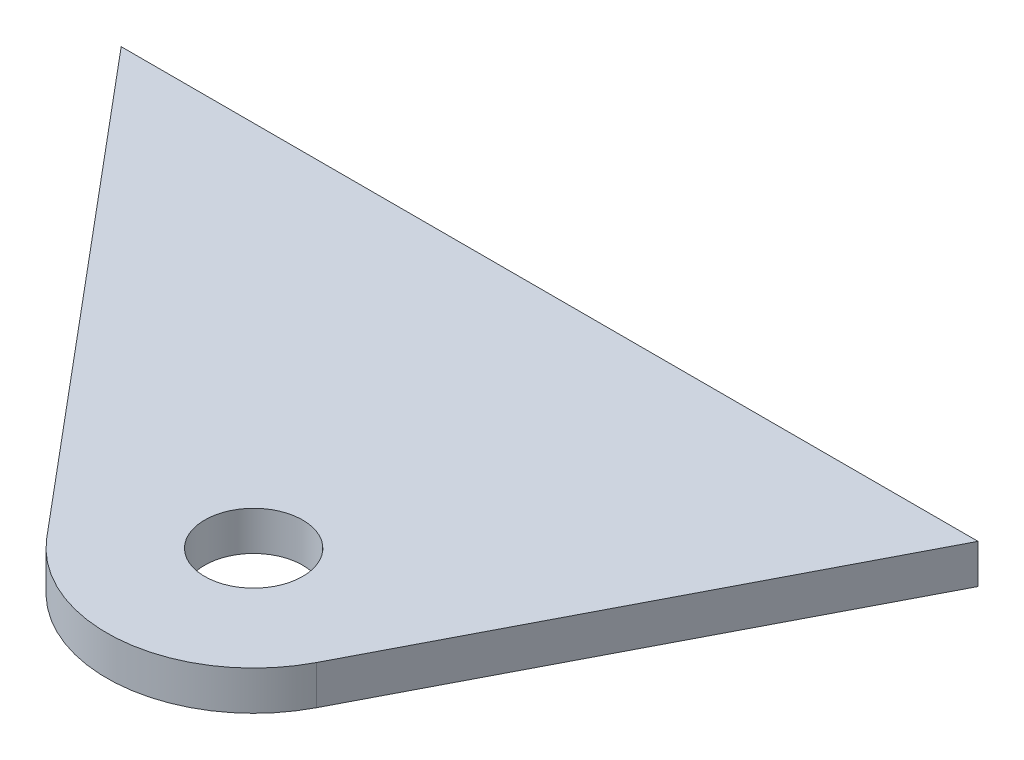
ISO-10303-21;
HEADER;
FILE_DESCRIPTION(('STEP AP214'),'2;1');
FILE_NAME('part.step','',(''),(''),'','','');
FILE_SCHEMA(('AUTOMOTIVE_DESIGN { 1 0 10303 214 1 1 1 1 }'));
ENDSEC;
DATA;
#1=APPLICATION_CONTEXT('core data for automotive mechanical design processes');
#2=APPLICATION_PROTOCOL_DEFINITION('international standard','automotive_design',2000,#1);
#3=PRODUCT_CONTEXT('',#1,'mechanical');
#4=PRODUCT('Part','Part','',(#3));
#5=PRODUCT_RELATED_PRODUCT_CATEGORY('part','',(#4));
#6=PRODUCT_DEFINITION_FORMATION('','',#4);
#7=PRODUCT_DEFINITION_CONTEXT('part definition',#1,'design');
#8=PRODUCT_DEFINITION('design','',#6,#7);
#9=PRODUCT_DEFINITION_SHAPE('','',#8);
#10=(LENGTH_UNIT() NAMED_UNIT(*) SI_UNIT(.MILLI.,.METRE.));
#11=(NAMED_UNIT(*) PLANE_ANGLE_UNIT() SI_UNIT($,.RADIAN.));
#12=(NAMED_UNIT(*) SI_UNIT($,.STERADIAN.) SOLID_ANGLE_UNIT());
#13=UNCERTAINTY_MEASURE_WITH_UNIT(LENGTH_MEASURE(1.E-05),#10,'distance_accuracy_value','');
#14=(GEOMETRIC_REPRESENTATION_CONTEXT(3) GLOBAL_UNCERTAINTY_ASSIGNED_CONTEXT((#13)) GLOBAL_UNIT_ASSIGNED_CONTEXT((#10,
#11,#12)) REPRESENTATION_CONTEXT('',''));
#15=CARTESIAN_POINT('',(0.,0.,0.));
#16=DIRECTION('',(0.,0.,1.));
#17=DIRECTION('',(1.,0.,0.));
#18=AXIS2_PLACEMENT_3D('',#15,#16,#17);
#19=CARTESIAN_POINT('',(101.6,354.33,279.4));
#20=DIRECTION('',(0.,-1.,0.));
#21=DIRECTION('',(1.,0.,0.));
#22=AXIS2_PLACEMENT_3D('',#19,#20,#21);
#23=PLANE('',#22);
#24=CARTESIAN_POINT('',(101.6,354.33,279.4));
#25=DIRECTION('',(0.,-1.,0.));
#26=DIRECTION('',(1.,0.,0.));
#27=AXIS2_PLACEMENT_3D('',#24,#25,#26);
#28=CIRCLE('',#27,3.175);
#29=CARTESIAN_POINT('',(104.775,354.33,279.4));
#30=VERTEX_POINT('',#29);
#31=EDGE_CURVE('E105',#30,#30,#28,.T.);
#32=ORIENTED_EDGE('',*,*,#31,.T.);
#33=EDGE_LOOP('',(#32));
#34=FACE_BOUND('',#33,.T.);
#35=DIRECTION('',(-0.642787609686537,0.,-0.76604444311898));
#36=VECTOR('',#35,1.);
#37=CARTESIAN_POINT('',(69.1316527751214,354.33,255.524));
#38=LINE('',#37,#36);
#39=CARTESIAN_POINT('',(94.3034266792917,354.33,285.522551982264));
#40=VERTEX_POINT('',#39);
#41=CARTESIAN_POINT('',(69.1316527751214,354.33,255.524));
#42=VERTEX_POINT('',#41);
#43=EDGE_CURVE('E96',#40,#42,#38,.T.);
#44=ORIENTED_EDGE('',*,*,#43,.F.);
#45=CARTESIAN_POINT('',(101.6,354.33,279.4));
#46=DIRECTION('',(0.,-1.,0.));
#47=DIRECTION('',(1.,0.,0.));
#48=AXIS2_PLACEMENT_3D('',#45,#46,#47);
#49=CIRCLE('',#48,9.52500000000001);
#50=CARTESIAN_POINT('',(110.056790071566,354.33,283.782730505685));
#51=VERTEX_POINT('',#50);
#52=EDGE_CURVE('E92',#51,#40,#49,.T.);
#53=ORIENTED_EDGE('',*,*,#52,.F.);
#54=DIRECTION('',(-0.460129186948612,0.,0.887851976017406));
#55=VECTOR('',#54,1.);
#56=CARTESIAN_POINT('',(124.701873985335,354.33,255.524));
#57=LINE('',#56,#55);
#58=CARTESIAN_POINT('',(124.701873985335,354.33,255.524));
#59=VERTEX_POINT('',#58);
#60=EDGE_CURVE('E83',#59,#51,#57,.T.);
#61=ORIENTED_EDGE('',*,*,#60,.F.);
#62=DIRECTION('',(1.,0.,0.));
#63=VECTOR('',#62,1.);
#64=CARTESIAN_POINT('',(69.1316527751214,354.33,255.524));
#65=LINE('',#64,#63);
#66=EDGE_CURVE('E90',#42,#59,#65,.T.);
#67=ORIENTED_EDGE('',*,*,#66,.F.);
#68=EDGE_LOOP('',(#44,#53,#61,#67));
#69=FACE_BOUND('',#68,.T.);
#70=ADVANCED_FACE('F37',(#34,#69),#23,.F.);
#71=CARTESIAN_POINT('',(101.6,354.33,279.4));
#72=DIRECTION('',(0.,-1.,0.));
#73=DIRECTION('',(1.,0.,0.));
#74=AXIS2_PLACEMENT_3D('',#71,#72,#73);
#75=CYLINDRICAL_SURFACE('',#74,9.52500000000001);
#76=CARTESIAN_POINT('',(101.6,351.79,279.4));
#77=DIRECTION('',(0.,-1.,0.));
#78=DIRECTION('',(1.,0.,0.));
#79=AXIS2_PLACEMENT_3D('',#76,#77,#78);
#80=CIRCLE('',#79,9.52500000000001);
#81=CARTESIAN_POINT('',(110.056790071566,351.79,283.782730505685));
#82=VERTEX_POINT('',#81);
#83=CARTESIAN_POINT('',(94.3034266792917,351.79,285.522551982264));
#84=VERTEX_POINT('',#83);
#85=EDGE_CURVE('E98',#82,#84,#80,.T.);
#86=ORIENTED_EDGE('',*,*,#85,.F.);
#87=DIRECTION('',(0.,-1.,0.));
#88=VECTOR('',#87,1.);
#89=CARTESIAN_POINT('',(110.056790071566,354.33,283.782730505685));
#90=LINE('',#89,#88);
#91=EDGE_CURVE('E47',#51,#82,#90,.T.);
#92=ORIENTED_EDGE('',*,*,#91,.F.);
#93=ORIENTED_EDGE('',*,*,#52,.T.);
#94=DIRECTION('',(0.,-1.,0.));
#95=VECTOR('',#94,1.);
#96=CARTESIAN_POINT('',(94.3034266792917,354.33,285.522551982264));
#97=LINE('',#96,#95);
#98=EDGE_CURVE('E11',#40,#84,#97,.T.);
#99=ORIENTED_EDGE('',*,*,#98,.T.);
#100=EDGE_LOOP('',(#86,#92,#93,#99));
#101=FACE_BOUND('',#100,.T.);
#102=ADVANCED_FACE('F110',(#101),#75,.T.);
#103=CARTESIAN_POINT('',(124.701873985335,354.33,255.524));
#104=DIRECTION('',(0.887851976017405,0.,0.460129186948612));
#105=DIRECTION('',(0.460129186948612,0.,-0.887851976017406));
#106=AXIS2_PLACEMENT_3D('',#103,#104,#105);
#107=PLANE('',#106);
#108=DIRECTION('',(-0.460129186948612,0.,0.887851976017406));
#109=VECTOR('',#108,1.);
#110=CARTESIAN_POINT('',(124.701873985335,351.79,255.524));
#111=LINE('',#110,#109);
#112=CARTESIAN_POINT('',(124.701873985335,351.79,255.524));
#113=VERTEX_POINT('',#112);
#114=EDGE_CURVE('E67',#113,#82,#111,.T.);
#115=ORIENTED_EDGE('',*,*,#114,.F.);
#116=DIRECTION('',(0.,-1.,0.));
#117=VECTOR('',#116,1.);
#118=CARTESIAN_POINT('',(124.701873985335,354.33,255.524));
#119=LINE('',#118,#117);
#120=EDGE_CURVE('E80',#59,#113,#119,.T.);
#121=ORIENTED_EDGE('',*,*,#120,.F.);
#122=ORIENTED_EDGE('',*,*,#60,.T.);
#123=ORIENTED_EDGE('',*,*,#91,.T.);
#124=EDGE_LOOP('',(#115,#121,#122,#123));
#125=FACE_BOUND('',#124,.T.);
#126=ADVANCED_FACE('F82',(#125),#107,.T.);
#127=CARTESIAN_POINT('',(69.1316527751214,354.33,255.524));
#128=DIRECTION('',(-0.76604444311898,0.,0.642787609686539));
#129=DIRECTION('',(0.642787609686537,0.,0.76604444311898));
#130=AXIS2_PLACEMENT_3D('',#127,#128,#129);
#131=PLANE('',#130);
#132=DIRECTION('',(0.,-1.,0.));
#133=VECTOR('',#132,1.);
#134=CARTESIAN_POINT('',(69.1316527751214,354.33,255.524));
#135=LINE('',#134,#133);
#136=CARTESIAN_POINT('',(69.1316527751214,351.79,255.524));
#137=VERTEX_POINT('',#136);
#138=EDGE_CURVE('E41',#42,#137,#135,.T.);
#139=ORIENTED_EDGE('',*,*,#138,.T.);
#140=DIRECTION('',(-0.642787609686537,0.,-0.76604444311898));
#141=VECTOR('',#140,1.);
#142=CARTESIAN_POINT('',(69.1316527751214,351.79,255.524));
#143=LINE('',#142,#141);
#144=EDGE_CURVE('E103',#84,#137,#143,.T.);
#145=ORIENTED_EDGE('',*,*,#144,.F.);
#146=ORIENTED_EDGE('',*,*,#98,.F.);
#147=ORIENTED_EDGE('',*,*,#43,.T.);
#148=EDGE_LOOP('',(#139,#145,#146,#147));
#149=FACE_BOUND('',#148,.T.);
#150=ADVANCED_FACE('F39',(#149),#131,.T.);
#151=CARTESIAN_POINT('',(101.6,354.33,279.4));
#152=DIRECTION('',(0.,-1.,0.));
#153=DIRECTION('',(1.,0.,0.));
#154=AXIS2_PLACEMENT_3D('',#151,#152,#153);
#155=CYLINDRICAL_SURFACE('',#154,3.175);
#156=ORIENTED_EDGE('',*,*,#31,.F.);
#157=EDGE_LOOP('',(#156));
#158=FACE_BOUND('',#157,.T.);
#159=CARTESIAN_POINT('',(101.6,351.79,279.4));
#160=DIRECTION('',(0.,-1.,0.));
#161=DIRECTION('',(1.,0.,0.));
#162=AXIS2_PLACEMENT_3D('',#159,#160,#161);
#163=CIRCLE('',#162,3.175);
#164=CARTESIAN_POINT('',(104.775,351.79,279.4));
#165=VERTEX_POINT('',#164);
#166=EDGE_CURVE('E113',#165,#165,#163,.T.);
#167=ORIENTED_EDGE('',*,*,#166,.T.);
#168=EDGE_LOOP('',(#167));
#169=FACE_BOUND('',#168,.T.);
#170=ADVANCED_FACE('F121',(#158,#169),#155,.F.);
#171=CARTESIAN_POINT('',(101.6,351.79,279.4));
#172=DIRECTION('',(0.,-1.,0.));
#173=DIRECTION('',(1.,0.,0.));
#174=AXIS2_PLACEMENT_3D('',#171,#172,#173);
#175=PLANE('',#174);
#176=ORIENTED_EDGE('',*,*,#166,.F.);
#177=EDGE_LOOP('',(#176));
#178=FACE_BOUND('',#177,.T.);
#179=ORIENTED_EDGE('',*,*,#144,.T.);
#180=DIRECTION('',(-1.,0.,0.));
#181=VECTOR('',#180,1.);
#182=CARTESIAN_POINT('',(124.701873985335,351.79,255.524));
#183=LINE('',#182,#181);
#184=EDGE_CURVE('E112',#113,#137,#183,.T.);
#185=ORIENTED_EDGE('',*,*,#184,.F.);
#186=ORIENTED_EDGE('',*,*,#114,.T.);
#187=ORIENTED_EDGE('',*,*,#85,.T.);
#188=EDGE_LOOP('',(#179,#185,#186,#187));
#189=FACE_BOUND('',#188,.T.);
#190=ADVANCED_FACE('F111',(#178,#189),#175,.T.);
#191=CARTESIAN_POINT('',(69.1316527751214,354.33,255.524));
#192=DIRECTION('',(0.,0.,-1.));
#193=DIRECTION('',(0.,1.,0.));
#194=AXIS2_PLACEMENT_3D('',#191,#192,#193);
#195=PLANE('',#194);
#196=ORIENTED_EDGE('',*,*,#120,.T.);
#197=ORIENTED_EDGE('',*,*,#184,.T.);
#198=ORIENTED_EDGE('',*,*,#138,.F.);
#199=ORIENTED_EDGE('',*,*,#66,.T.);
#200=EDGE_LOOP('',(#196,#197,#198,#199));
#201=FACE_BOUND('',#200,.T.);
#202=ADVANCED_FACE('F94',(#201),#195,.T.);
#203=CLOSED_SHELL('',(#70,#102,#126,#150,#170,#190,#202));
#204=MANIFOLD_SOLID_BREP('B2',#203);
#205=ADVANCED_BREP_SHAPE_REPRESENTATION('',(#18,#204),#14);
#206=SHAPE_DEFINITION_REPRESENTATION(#9,#205);
ENDSEC;
END-ISO-10303-21;
